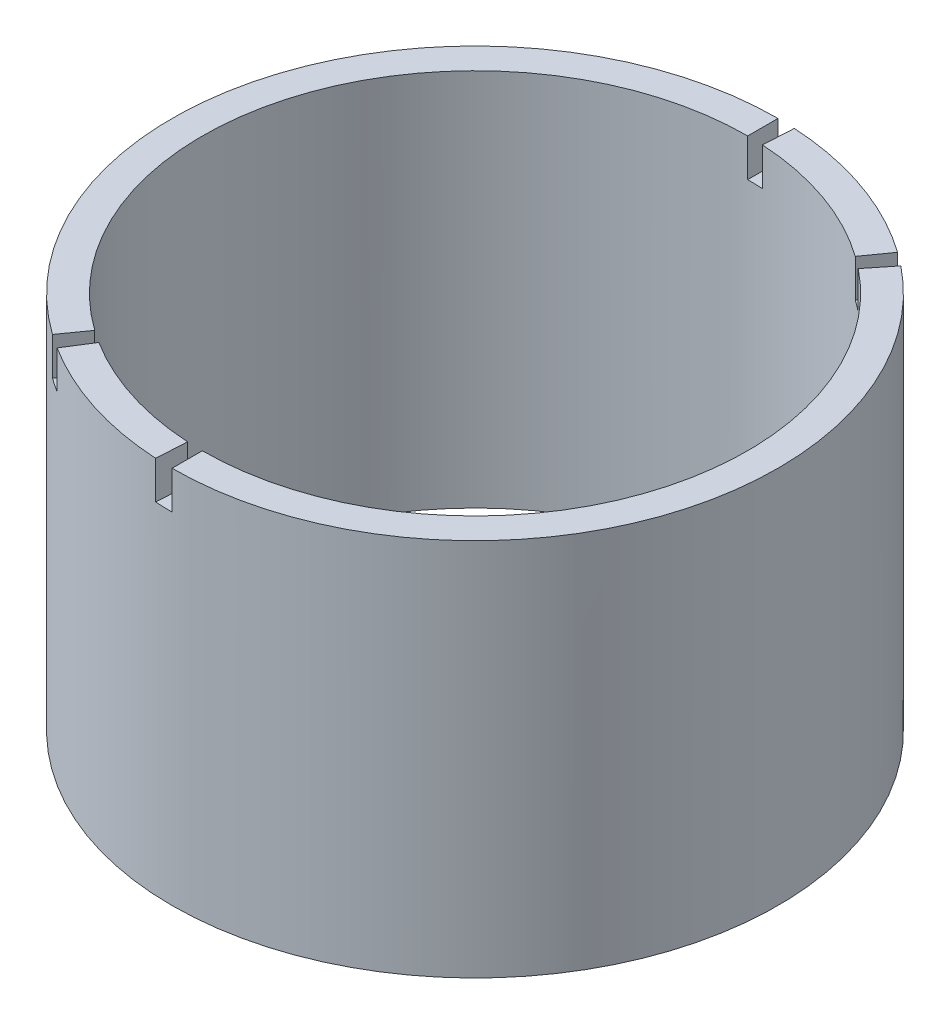
ISO-10303-21;
HEADER;
FILE_DESCRIPTION(('STEP AP214'),'2;1');
FILE_NAME('part.step','',(''),(''),'','','');
FILE_SCHEMA(('AUTOMOTIVE_DESIGN { 1 0 10303 214 1 1 1 1 }'));
ENDSEC;
DATA;
#1=APPLICATION_CONTEXT('core data for automotive mechanical design processes');
#2=APPLICATION_PROTOCOL_DEFINITION('international standard','automotive_design',2000,#1);
#3=PRODUCT_CONTEXT('',#1,'mechanical');
#4=PRODUCT('Part','Part','',(#3));
#5=PRODUCT_RELATED_PRODUCT_CATEGORY('part','',(#4));
#6=PRODUCT_DEFINITION_FORMATION('','',#4);
#7=PRODUCT_DEFINITION_CONTEXT('part definition',#1,'design');
#8=PRODUCT_DEFINITION('design','',#6,#7);
#9=PRODUCT_DEFINITION_SHAPE('','',#8);
#10=(LENGTH_UNIT() NAMED_UNIT(*) SI_UNIT(.MILLI.,.METRE.));
#11=(NAMED_UNIT(*) PLANE_ANGLE_UNIT() SI_UNIT($,.RADIAN.));
#12=(NAMED_UNIT(*) SI_UNIT($,.STERADIAN.) SOLID_ANGLE_UNIT());
#13=UNCERTAINTY_MEASURE_WITH_UNIT(LENGTH_MEASURE(1.E-05),#10,'distance_accuracy_value','');
#14=(GEOMETRIC_REPRESENTATION_CONTEXT(3) GLOBAL_UNCERTAINTY_ASSIGNED_CONTEXT((#13)) GLOBAL_UNIT_ASSIGNED_CONTEXT((#10,
#11,#12)) REPRESENTATION_CONTEXT('',''));
#15=CARTESIAN_POINT('',(0.,0.,0.));
#16=DIRECTION('',(0.,0.,1.));
#17=DIRECTION('',(1.,0.,0.));
#18=AXIS2_PLACEMENT_3D('',#15,#16,#17);
#19=CARTESIAN_POINT('',(0.,50.,0.));
#20=DIRECTION('',(0.,1.,0.));
#21=DIRECTION('',(0.,0.,1.));
#22=AXIS2_PLACEMENT_3D('',#19,#20,#21);
#23=PLANE('',#22);
#24=DIRECTION('',(-0.579849798546337,0.,0.814723395469758));
#25=VECTOR('',#24,1.);
#26=CARTESIAN_POINT('',(-23.1939919418535,50.,32.5889358187903));
#27=LINE('',#26,#25);
#28=CARTESIAN_POINT('',(-20.8745927476682,50.,29.3300422369113));
#29=VERTEX_POINT('',#28);
#30=CARTESIAN_POINT('',(-23.1939919418535,50.,32.5889358187903));
#31=VERTEX_POINT('',#30);
#32=EDGE_CURVE('E161',#29,#31,#27,.T.);
#33=ORIENTED_EDGE('',*,*,#32,.F.);
#34=CARTESIAN_POINT('',(0.,50.,0.));
#35=DIRECTION('',(0.,1.,0.));
#36=DIRECTION('',(0.,0.,1.));
#37=AXIS2_PLACEMENT_3D('',#34,#35,#36);
#38=CIRCLE('',#37,36.);
#39=CARTESIAN_POINT('',(0.,50.,-36.));
#40=VERTEX_POINT('',#39);
#41=EDGE_CURVE('E247',#40,#29,#38,.T.);
#42=ORIENTED_EDGE('',*,*,#41,.F.);
#43=DIRECTION('',(0.,0.,1.));
#44=VECTOR('',#43,1.);
#45=CARTESIAN_POINT('',(0.,50.,-40.));
#46=LINE('',#45,#44);
#47=CARTESIAN_POINT('',(0.,50.,-40.));
#48=VERTEX_POINT('',#47);
#49=EDGE_CURVE('E213',#48,#40,#46,.T.);
#50=ORIENTED_EDGE('',*,*,#49,.F.);
#51=CARTESIAN_POINT('',(0.,50.,0.));
#52=DIRECTION('',(0.,1.,0.));
#53=DIRECTION('',(0.,0.,1.));
#54=AXIS2_PLACEMENT_3D('',#51,#52,#53);
#55=CIRCLE('',#54,40.);
#56=EDGE_CURVE('E11',#48,#31,#55,.T.);
#57=ORIENTED_EDGE('',*,*,#56,.T.);
#58=EDGE_LOOP('',(#33,#42,#50,#57));
#59=FACE_BOUND('',#58,.T.);
#60=ADVANCED_FACE('F31',(#59),#23,.T.);
#61=DIRECTION('',(0.624199913750063,0.,-0.781264659174095));
#62=VECTOR('',#61,1.);
#63=CARTESIAN_POINT('',(24.9679965500025,50.,-31.2505863669638));
#64=LINE('',#63,#62);
#65=CARTESIAN_POINT('',(22.4711968950023,50.,-28.1255277302674));
#66=VERTEX_POINT('',#65);
#67=CARTESIAN_POINT('',(24.9679965500025,50.,-31.2505863669638));
#68=VERTEX_POINT('',#67);
#69=EDGE_CURVE('E174',#66,#68,#64,.T.);
#70=ORIENTED_EDGE('',*,*,#69,.F.);
#71=CARTESIAN_POINT('',(0.,50.,36.));
#72=VERTEX_POINT('',#71);
#73=EDGE_CURVE('E251',#72,#66,#38,.T.);
#74=ORIENTED_EDGE('',*,*,#73,.F.);
#75=DIRECTION('',(0.,0.,-1.));
#76=VECTOR('',#75,1.);
#77=CARTESIAN_POINT('',(0.,50.,40.));
#78=LINE('',#77,#76);
#79=CARTESIAN_POINT('',(0.,50.,40.));
#80=VERTEX_POINT('',#79);
#81=EDGE_CURVE('E189',#80,#72,#78,.T.);
#82=ORIENTED_EDGE('',*,*,#81,.F.);
#83=EDGE_CURVE('E41',#80,#68,#55,.T.);
#84=ORIENTED_EDGE('',*,*,#83,.T.);
#85=EDGE_LOOP('',(#70,#74,#82,#84));
#86=FACE_BOUND('',#85,.T.);
#87=ADVANCED_FACE('F291',(#86),#23,.T.);
#88=DIRECTION('',(0.533710023470557,0.,-0.845667553384341));
#89=VECTOR('',#88,1.);
#90=CARTESIAN_POINT('',(-21.3484009388223,50.,33.8267021353737));
#91=LINE('',#90,#89);
#92=CARTESIAN_POINT('',(-21.3484009388223,50.,33.8267021353737));
#93=VERTEX_POINT('',#92);
#94=CARTESIAN_POINT('',(-19.21356084494,50.,30.4440319218363));
#95=VERTEX_POINT('',#94);
#96=EDGE_CURVE('E272',#93,#95,#91,.T.);
#97=ORIENTED_EDGE('',*,*,#96,.F.);
#98=CARTESIAN_POINT('',(-2.22222222222222,50.,39.9382239013587));
#99=VERTEX_POINT('',#98);
#100=EDGE_CURVE('E40',#93,#99,#55,.T.);
#101=ORIENTED_EDGE('',*,*,#100,.T.);
#102=DIRECTION('',(-0.0555555555555553,0.,0.998455597533968));
#103=VECTOR('',#102,1.);
#104=CARTESIAN_POINT('',(-2.22222222222222,50.,39.9382239013587));
#105=LINE('',#104,#103);
#106=CARTESIAN_POINT('',(-2.,50.,35.9444015112229));
#107=VERTEX_POINT('',#106);
#108=EDGE_CURVE('E200',#107,#99,#105,.T.);
#109=ORIENTED_EDGE('',*,*,#108,.F.);
#110=EDGE_CURVE('E250',#95,#107,#38,.T.);
#111=ORIENTED_EDGE('',*,*,#110,.F.);
#112=EDGE_LOOP('',(#97,#101,#109,#111));
#113=FACE_BOUND('',#112,.T.);
#114=ADVANCED_FACE('F271',(#113),#23,.T.);
#115=DIRECTION('',(-0.579849798546339,0.,0.814723395469757));
#116=VECTOR('',#115,1.);
#117=CARTESIAN_POINT('',(23.1939919418535,50.,-32.5889358187903));
#118=LINE('',#117,#116);
#119=CARTESIAN_POINT('',(23.1939919418535,50.,-32.5889358187903));
#120=VERTEX_POINT('',#119);
#121=CARTESIAN_POINT('',(20.8745927476682,50.,-29.3300422369113));
#122=VERTEX_POINT('',#121);
#123=EDGE_CURVE('E182',#120,#122,#118,.T.);
#124=ORIENTED_EDGE('',*,*,#123,.F.);
#125=CARTESIAN_POINT('',(2.22222222222221,50.,-39.9382239013587));
#126=VERTEX_POINT('',#125);
#127=EDGE_CURVE('E273',#120,#126,#55,.T.);
#128=ORIENTED_EDGE('',*,*,#127,.T.);
#129=DIRECTION('',(0.0555555555555553,0.,-0.998455597533968));
#130=VECTOR('',#129,1.);
#131=CARTESIAN_POINT('',(2.22222222222221,50.,-39.9382239013587));
#132=LINE('',#131,#130);
#133=CARTESIAN_POINT('',(1.99999999999999,50.,-35.9444015112229));
#134=VERTEX_POINT('',#133);
#135=EDGE_CURVE('E225',#134,#126,#132,.T.);
#136=ORIENTED_EDGE('',*,*,#135,.F.);
#137=EDGE_CURVE('E253',#122,#134,#38,.T.);
#138=ORIENTED_EDGE('',*,*,#137,.F.);
#139=EDGE_LOOP('',(#124,#128,#136,#138));
#140=FACE_BOUND('',#139,.T.);
#141=ADVANCED_FACE('F284',(#140),#23,.T.);
#142=CARTESIAN_POINT('',(0.,0.,0.));
#143=DIRECTION('',(0.,1.,0.));
#144=DIRECTION('',(0.,0.,1.));
#145=AXIS2_PLACEMENT_3D('',#142,#143,#144);
#146=PLANE('',#145);
#147=CARTESIAN_POINT('',(0.,0.,0.));
#148=DIRECTION('',(0.,1.,0.));
#149=DIRECTION('',(0.,0.,1.));
#150=AXIS2_PLACEMENT_3D('',#147,#148,#149);
#151=CIRCLE('',#150,40.);
#152=CARTESIAN_POINT('',(0.,0.,40.));
#153=VERTEX_POINT('',#152);
#154=EDGE_CURVE('E35',#153,#153,#151,.T.);
#155=ORIENTED_EDGE('',*,*,#154,.F.);
#156=EDGE_LOOP('',(#155));
#157=FACE_BOUND('',#156,.T.);
#158=CARTESIAN_POINT('',(0.,0.,0.));
#159=DIRECTION('',(0.,1.,0.));
#160=DIRECTION('',(0.,0.,1.));
#161=AXIS2_PLACEMENT_3D('',#158,#159,#160);
#162=CIRCLE('',#161,36.);
#163=CARTESIAN_POINT('',(0.,0.,36.));
#164=VERTEX_POINT('',#163);
#165=EDGE_CURVE('E239',#164,#164,#162,.T.);
#166=ORIENTED_EDGE('',*,*,#165,.T.);
#167=EDGE_LOOP('',(#166));
#168=FACE_BOUND('',#167,.T.);
#169=ADVANCED_FACE('F282',(#157,#168),#146,.F.);
#170=CARTESIAN_POINT('',(0.,50.,0.));
#171=DIRECTION('',(0.,-1.,0.));
#172=DIRECTION('',(0.,0.,-1.));
#173=AXIS2_PLACEMENT_3D('',#170,#171,#172);
#174=CYLINDRICAL_SURFACE('',#173,40.);
#175=CARTESIAN_POINT('',(0.,45.,0.));
#176=DIRECTION('',(0.,1.,0.));
#177=DIRECTION('',(0.,0.,-1.));
#178=AXIS2_PLACEMENT_3D('',#175,#176,#177);
#179=CIRCLE('',#178,40.);
#180=CARTESIAN_POINT('',(-23.1939919418535,45.,32.5889358187903));
#181=VERTEX_POINT('',#180);
#182=CARTESIAN_POINT('',(-21.3484009388223,45.,33.8267021353737));
#183=VERTEX_POINT('',#182);
#184=EDGE_CURVE('E152',#181,#183,#179,.T.);
#185=ORIENTED_EDGE('',*,*,#184,.F.);
#186=DIRECTION('',(0.,1.,0.));
#187=VECTOR('',#186,1.);
#188=CARTESIAN_POINT('',(-23.1939919418535,45.,32.5889358187903));
#189=LINE('',#188,#187);
#190=EDGE_CURVE('E184',#181,#31,#189,.T.);
#191=ORIENTED_EDGE('',*,*,#190,.T.);
#192=ORIENTED_EDGE('',*,*,#56,.F.);
#193=DIRECTION('',(0.,1.,0.));
#194=VECTOR('',#193,1.);
#195=CARTESIAN_POINT('',(0.,45.,-40.));
#196=LINE('',#195,#194);
#197=CARTESIAN_POINT('',(0.,45.,-40.));
#198=VERTEX_POINT('',#197);
#199=EDGE_CURVE('E232',#198,#48,#196,.T.);
#200=ORIENTED_EDGE('',*,*,#199,.F.);
#201=CARTESIAN_POINT('',(0.,45.,0.));
#202=DIRECTION('',(0.,1.,0.));
#203=DIRECTION('',(0.,0.,-1.));
#204=AXIS2_PLACEMENT_3D('',#201,#202,#203);
#205=CIRCLE('',#204,40.);
#206=CARTESIAN_POINT('',(2.22222222222221,45.,-39.9382239013587));
#207=VERTEX_POINT('',#206);
#208=EDGE_CURVE('E221',#207,#198,#205,.T.);
#209=ORIENTED_EDGE('',*,*,#208,.F.);
#210=DIRECTION('',(0.,1.,0.));
#211=VECTOR('',#210,1.);
#212=CARTESIAN_POINT('',(2.22222222222221,45.,-39.9382239013587));
#213=LINE('',#212,#211);
#214=EDGE_CURVE('E236',#207,#126,#213,.T.);
#215=ORIENTED_EDGE('',*,*,#214,.T.);
#216=ORIENTED_EDGE('',*,*,#127,.F.);
#217=DIRECTION('',(0.,1.,0.));
#218=VECTOR('',#217,1.);
#219=CARTESIAN_POINT('',(23.1939919418535,45.,-32.5889358187903));
#220=LINE('',#219,#218);
#221=CARTESIAN_POINT('',(23.1939919418535,45.,-32.5889358187903));
#222=VERTEX_POINT('',#221);
#223=EDGE_CURVE('E181',#222,#120,#220,.T.);
#224=ORIENTED_EDGE('',*,*,#223,.F.);
#225=CARTESIAN_POINT('',(0.,45.,0.));
#226=DIRECTION('',(0.,1.,0.));
#227=DIRECTION('',(0.,0.,-1.));
#228=AXIS2_PLACEMENT_3D('',#225,#226,#227);
#229=CIRCLE('',#228,40.);
#230=CARTESIAN_POINT('',(24.9679965500025,45.,-31.2505863669638));
#231=VERTEX_POINT('',#230);
#232=EDGE_CURVE('E172',#231,#222,#229,.T.);
#233=ORIENTED_EDGE('',*,*,#232,.F.);
#234=DIRECTION('',(0.,1.,0.));
#235=VECTOR('',#234,1.);
#236=CARTESIAN_POINT('',(24.9679965500025,45.,-31.2505863669638));
#237=LINE('',#236,#235);
#238=EDGE_CURVE('E186',#231,#68,#237,.T.);
#239=ORIENTED_EDGE('',*,*,#238,.T.);
#240=ORIENTED_EDGE('',*,*,#83,.F.);
#241=DIRECTION('',(0.,1.,0.));
#242=VECTOR('',#241,1.);
#243=CARTESIAN_POINT('',(0.,45.,40.));
#244=LINE('',#243,#242);
#245=CARTESIAN_POINT('',(0.,45.,40.));
#246=VERTEX_POINT('',#245);
#247=EDGE_CURVE('E207',#246,#80,#244,.T.);
#248=ORIENTED_EDGE('',*,*,#247,.F.);
#249=CARTESIAN_POINT('',(0.,45.,0.));
#250=DIRECTION('',(0.,1.,0.));
#251=DIRECTION('',(0.,0.,1.));
#252=AXIS2_PLACEMENT_3D('',#249,#250,#251);
#253=CIRCLE('',#252,40.);
#254=CARTESIAN_POINT('',(-2.22222222222222,45.,39.9382239013587));
#255=VERTEX_POINT('',#254);
#256=EDGE_CURVE('E196',#255,#246,#253,.T.);
#257=ORIENTED_EDGE('',*,*,#256,.F.);
#258=DIRECTION('',(0.,1.,0.));
#259=VECTOR('',#258,1.);
#260=CARTESIAN_POINT('',(-2.22222222222222,45.,39.9382239013587));
#261=LINE('',#260,#259);
#262=EDGE_CURVE('E211',#255,#99,#261,.T.);
#263=ORIENTED_EDGE('',*,*,#262,.T.);
#264=ORIENTED_EDGE('',*,*,#100,.F.);
#265=DIRECTION('',(0.,1.,0.));
#266=VECTOR('',#265,1.);
#267=CARTESIAN_POINT('',(-21.3484009388223,45.,33.8267021353737));
#268=LINE('',#267,#266);
#269=EDGE_CURVE('E146',#183,#93,#268,.T.);
#270=ORIENTED_EDGE('',*,*,#269,.F.);
#271=EDGE_LOOP('',(#185,#191,#192,#200,#209,#215,#216,#224,#233,#239,#240,#248,#257,#263,#264,#270));
#272=FACE_BOUND('',#271,.T.);
#273=ORIENTED_EDGE('',*,*,#154,.T.);
#274=EDGE_LOOP('',(#273));
#275=FACE_BOUND('',#274,.T.);
#276=ADVANCED_FACE('F33',(#272,#275),#174,.T.);
#277=CARTESIAN_POINT('',(0.,50.,0.));
#278=DIRECTION('',(0.,-1.,0.));
#279=DIRECTION('',(0.,0.,-1.));
#280=AXIS2_PLACEMENT_3D('',#277,#278,#279);
#281=CYLINDRICAL_SURFACE('',#280,36.);
#282=DIRECTION('',(0.,1.,0.));
#283=VECTOR('',#282,1.);
#284=CARTESIAN_POINT('',(-20.8745927476682,45.,29.3300422369113));
#285=LINE('',#284,#283);
#286=CARTESIAN_POINT('',(-20.8745927476682,45.,29.3300422369113));
#287=VERTEX_POINT('',#286);
#288=EDGE_CURVE('E167',#287,#29,#285,.T.);
#289=ORIENTED_EDGE('',*,*,#288,.F.);
#290=CARTESIAN_POINT('',(0.,45.,0.));
#291=DIRECTION('',(0.,-1.,0.));
#292=DIRECTION('',(0.,0.,-1.));
#293=AXIS2_PLACEMENT_3D('',#290,#291,#292);
#294=CIRCLE('',#293,36.);
#295=CARTESIAN_POINT('',(-19.21356084494,45.,30.4440319218363));
#296=VERTEX_POINT('',#295);
#297=EDGE_CURVE('E151',#296,#287,#294,.T.);
#298=ORIENTED_EDGE('',*,*,#297,.F.);
#299=DIRECTION('',(0.,1.,0.));
#300=VECTOR('',#299,1.);
#301=CARTESIAN_POINT('',(-19.21356084494,45.,30.4440319218363));
#302=LINE('',#301,#300);
#303=EDGE_CURVE('E149',#296,#95,#302,.T.);
#304=ORIENTED_EDGE('',*,*,#303,.T.);
#305=ORIENTED_EDGE('',*,*,#110,.T.);
#306=DIRECTION('',(0.,1.,0.));
#307=VECTOR('',#306,1.);
#308=CARTESIAN_POINT('',(-2.,45.,35.9444015112229));
#309=LINE('',#308,#307);
#310=CARTESIAN_POINT('',(-2.,45.,35.9444015112229));
#311=VERTEX_POINT('',#310);
#312=EDGE_CURVE('E214',#311,#107,#309,.T.);
#313=ORIENTED_EDGE('',*,*,#312,.F.);
#314=CARTESIAN_POINT('',(0.,45.,0.));
#315=DIRECTION('',(0.,-1.,0.));
#316=DIRECTION('',(0.,0.,1.));
#317=AXIS2_PLACEMENT_3D('',#314,#315,#316);
#318=CIRCLE('',#317,36.);
#319=CARTESIAN_POINT('',(0.,45.,36.));
#320=VERTEX_POINT('',#319);
#321=EDGE_CURVE('E202',#320,#311,#318,.T.);
#322=ORIENTED_EDGE('',*,*,#321,.F.);
#323=DIRECTION('',(0.,1.,0.));
#324=VECTOR('',#323,1.);
#325=CARTESIAN_POINT('',(0.,45.,36.));
#326=LINE('',#325,#324);
#327=EDGE_CURVE('E217',#320,#72,#326,.T.);
#328=ORIENTED_EDGE('',*,*,#327,.T.);
#329=ORIENTED_EDGE('',*,*,#73,.T.);
#330=DIRECTION('',(0.,1.,0.));
#331=VECTOR('',#330,1.);
#332=CARTESIAN_POINT('',(22.4711968950023,45.,-28.1255277302674));
#333=LINE('',#332,#331);
#334=CARTESIAN_POINT('',(22.4711968950023,45.,-28.1255277302674));
#335=VERTEX_POINT('',#334);
#336=EDGE_CURVE('E190',#335,#66,#333,.T.);
#337=ORIENTED_EDGE('',*,*,#336,.F.);
#338=CARTESIAN_POINT('',(0.,45.,0.));
#339=DIRECTION('',(0.,-1.,0.));
#340=DIRECTION('',(0.,0.,-1.));
#341=AXIS2_PLACEMENT_3D('',#338,#339,#340);
#342=CIRCLE('',#341,36.);
#343=CARTESIAN_POINT('',(20.8745927476682,45.,-29.3300422369113));
#344=VERTEX_POINT('',#343);
#345=EDGE_CURVE('E176',#344,#335,#342,.T.);
#346=ORIENTED_EDGE('',*,*,#345,.F.);
#347=DIRECTION('',(0.,1.,0.));
#348=VECTOR('',#347,1.);
#349=CARTESIAN_POINT('',(20.8745927476682,45.,-29.3300422369113));
#350=LINE('',#349,#348);
#351=EDGE_CURVE('E192',#344,#122,#350,.T.);
#352=ORIENTED_EDGE('',*,*,#351,.T.);
#353=ORIENTED_EDGE('',*,*,#137,.T.);
#354=DIRECTION('',(0.,1.,0.));
#355=VECTOR('',#354,1.);
#356=CARTESIAN_POINT('',(1.99999999999999,45.,-35.9444015112229));
#357=LINE('',#356,#355);
#358=CARTESIAN_POINT('',(1.99999999999999,45.,-35.9444015112229));
#359=VERTEX_POINT('',#358);
#360=EDGE_CURVE('E240',#359,#134,#357,.T.);
#361=ORIENTED_EDGE('',*,*,#360,.F.);
#362=CARTESIAN_POINT('',(0.,45.,0.));
#363=DIRECTION('',(0.,-1.,0.));
#364=DIRECTION('',(0.,0.,-1.));
#365=AXIS2_PLACEMENT_3D('',#362,#363,#364);
#366=CIRCLE('',#365,36.);
#367=CARTESIAN_POINT('',(0.,45.,-36.));
#368=VERTEX_POINT('',#367);
#369=EDGE_CURVE('E227',#368,#359,#366,.T.);
#370=ORIENTED_EDGE('',*,*,#369,.F.);
#371=DIRECTION('',(0.,1.,0.));
#372=VECTOR('',#371,1.);
#373=CARTESIAN_POINT('',(0.,45.,-36.));
#374=LINE('',#373,#372);
#375=EDGE_CURVE('E243',#368,#40,#374,.T.);
#376=ORIENTED_EDGE('',*,*,#375,.T.);
#377=ORIENTED_EDGE('',*,*,#41,.T.);
#378=EDGE_LOOP('',(#289,#298,#304,#305,#313,#322,#328,#329,#337,#346,#352,#353,#361,#370,#376,#377));
#379=FACE_BOUND('',#378,.T.);
#380=ORIENTED_EDGE('',*,*,#165,.F.);
#381=EDGE_LOOP('',(#380));
#382=FACE_BOUND('',#381,.T.);
#383=ADVANCED_FACE('F263',(#379,#382),#281,.F.);
#384=CARTESIAN_POINT('',(2.22222222222221,45.,-39.9382239013587));
#385=DIRECTION('',(0.998455597533968,0.,0.0555555555555553));
#386=DIRECTION('',(0.0555555555555553,0.,-0.998455597533968));
#387=AXIS2_PLACEMENT_3D('',#384,#385,#386);
#388=PLANE('',#387);
#389=ORIENTED_EDGE('',*,*,#135,.T.);
#390=ORIENTED_EDGE('',*,*,#214,.F.);
#391=DIRECTION('',(0.0555555555555553,0.,-0.998455597533968));
#392=VECTOR('',#391,1.);
#393=CARTESIAN_POINT('',(2.22222222222221,45.,-39.9382239013587));
#394=LINE('',#393,#392);
#395=EDGE_CURVE('E229',#359,#207,#394,.T.);
#396=ORIENTED_EDGE('',*,*,#395,.F.);
#397=ORIENTED_EDGE('',*,*,#360,.T.);
#398=EDGE_LOOP('',(#389,#390,#396,#397));
#399=FACE_BOUND('',#398,.T.);
#400=ADVANCED_FACE('F301',(#399),#388,.F.);
#401=CARTESIAN_POINT('',(0.,45.,-40.));
#402=DIRECTION('',(-1.,0.,0.));
#403=DIRECTION('',(0.,0.,1.));
#404=AXIS2_PLACEMENT_3D('',#401,#402,#403);
#405=PLANE('',#404);
#406=ORIENTED_EDGE('',*,*,#49,.T.);
#407=ORIENTED_EDGE('',*,*,#375,.F.);
#408=DIRECTION('',(0.,0.,1.));
#409=VECTOR('',#408,1.);
#410=CARTESIAN_POINT('',(0.,45.,-40.));
#411=LINE('',#410,#409);
#412=EDGE_CURVE('E224',#198,#368,#411,.T.);
#413=ORIENTED_EDGE('',*,*,#412,.F.);
#414=ORIENTED_EDGE('',*,*,#199,.T.);
#415=EDGE_LOOP('',(#406,#407,#413,#414));
#416=FACE_BOUND('',#415,.T.);
#417=ADVANCED_FACE('F302',(#416),#405,.F.);
#418=CARTESIAN_POINT('',(0.,45.,0.));
#419=DIRECTION('',(0.,-1.,0.));
#420=DIRECTION('',(0.,0.,-1.));
#421=AXIS2_PLACEMENT_3D('',#418,#419,#420);
#422=PLANE('',#421);
#423=ORIENTED_EDGE('',*,*,#208,.T.);
#424=ORIENTED_EDGE('',*,*,#412,.T.);
#425=ORIENTED_EDGE('',*,*,#369,.T.);
#426=ORIENTED_EDGE('',*,*,#395,.T.);
#427=EDGE_LOOP('',(#423,#424,#425,#426));
#428=FACE_BOUND('',#427,.T.);
#429=ADVANCED_FACE('F305',(#428),#422,.F.);
#430=CARTESIAN_POINT('',(-2.22222222222222,45.,39.9382239013587));
#431=DIRECTION('',(-0.998455597533968,0.,-0.0555555555555553));
#432=DIRECTION('',(-0.0555555555555553,0.,0.998455597533968));
#433=AXIS2_PLACEMENT_3D('',#430,#431,#432);
#434=PLANE('',#433);
#435=ORIENTED_EDGE('',*,*,#108,.T.);
#436=ORIENTED_EDGE('',*,*,#262,.F.);
#437=DIRECTION('',(-0.0555555555555553,0.,0.998455597533968));
#438=VECTOR('',#437,1.);
#439=CARTESIAN_POINT('',(-2.22222222222222,45.,39.9382239013587));
#440=LINE('',#439,#438);
#441=EDGE_CURVE('E204',#311,#255,#440,.T.);
#442=ORIENTED_EDGE('',*,*,#441,.F.);
#443=ORIENTED_EDGE('',*,*,#312,.T.);
#444=EDGE_LOOP('',(#435,#436,#442,#443));
#445=FACE_BOUND('',#444,.T.);
#446=ADVANCED_FACE('F270',(#445),#434,.F.);
#447=CARTESIAN_POINT('',(0.,45.,40.));
#448=DIRECTION('',(1.,0.,0.));
#449=DIRECTION('',(0.,0.,-1.));
#450=AXIS2_PLACEMENT_3D('',#447,#448,#449);
#451=PLANE('',#450);
#452=ORIENTED_EDGE('',*,*,#81,.T.);
#453=ORIENTED_EDGE('',*,*,#327,.F.);
#454=DIRECTION('',(0.,0.,-1.));
#455=VECTOR('',#454,1.);
#456=CARTESIAN_POINT('',(0.,45.,40.));
#457=LINE('',#456,#455);
#458=EDGE_CURVE('E199',#246,#320,#457,.T.);
#459=ORIENTED_EDGE('',*,*,#458,.F.);
#460=ORIENTED_EDGE('',*,*,#247,.T.);
#461=EDGE_LOOP('',(#452,#453,#459,#460));
#462=FACE_BOUND('',#461,.T.);
#463=ADVANCED_FACE('F313',(#462),#451,.F.);
#464=CARTESIAN_POINT('',(0.,45.,0.));
#465=DIRECTION('',(0.,1.,0.));
#466=DIRECTION('',(0.,0.,1.));
#467=AXIS2_PLACEMENT_3D('',#464,#465,#466);
#468=PLANE('',#467);
#469=ORIENTED_EDGE('',*,*,#256,.T.);
#470=ORIENTED_EDGE('',*,*,#458,.T.);
#471=ORIENTED_EDGE('',*,*,#321,.T.);
#472=ORIENTED_EDGE('',*,*,#441,.T.);
#473=EDGE_LOOP('',(#469,#470,#471,#472));
#474=FACE_BOUND('',#473,.T.);
#475=ADVANCED_FACE('F316',(#474),#468,.T.);
#476=CARTESIAN_POINT('',(24.9679965500025,45.,-31.2505863669638));
#477=DIRECTION('',(0.781264659174095,0.,0.624199913750063));
#478=DIRECTION('',(0.624199913750063,0.,-0.781264659174095));
#479=AXIS2_PLACEMENT_3D('',#476,#477,#478);
#480=PLANE('',#479);
#481=ORIENTED_EDGE('',*,*,#69,.T.);
#482=ORIENTED_EDGE('',*,*,#238,.F.);
#483=DIRECTION('',(0.624199913750063,0.,-0.781264659174095));
#484=VECTOR('',#483,1.);
#485=CARTESIAN_POINT('',(24.9679965500025,45.,-31.2505863669638));
#486=LINE('',#485,#484);
#487=EDGE_CURVE('E178',#335,#231,#486,.T.);
#488=ORIENTED_EDGE('',*,*,#487,.F.);
#489=ORIENTED_EDGE('',*,*,#336,.T.);
#490=EDGE_LOOP('',(#481,#482,#488,#489));
#491=FACE_BOUND('',#490,.T.);
#492=ADVANCED_FACE('F322',(#491),#480,.F.);
#493=CARTESIAN_POINT('',(23.1939919418535,45.,-32.5889358187903));
#494=DIRECTION('',(-0.814723395469757,0.,-0.579849798546339));
#495=DIRECTION('',(-0.579849798546339,0.,0.814723395469757));
#496=AXIS2_PLACEMENT_3D('',#493,#494,#495);
#497=PLANE('',#496);
#498=ORIENTED_EDGE('',*,*,#123,.T.);
#499=ORIENTED_EDGE('',*,*,#351,.F.);
#500=DIRECTION('',(-0.579849798546339,0.,0.814723395469757));
#501=VECTOR('',#500,1.);
#502=CARTESIAN_POINT('',(23.1939919418535,45.,-32.5889358187903));
#503=LINE('',#502,#501);
#504=EDGE_CURVE('E56',#222,#344,#503,.T.);
#505=ORIENTED_EDGE('',*,*,#504,.F.);
#506=ORIENTED_EDGE('',*,*,#223,.T.);
#507=EDGE_LOOP('',(#498,#499,#505,#506));
#508=FACE_BOUND('',#507,.T.);
#509=ADVANCED_FACE('F324',(#508),#497,.F.);
#510=CARTESIAN_POINT('',(0.,45.,0.));
#511=DIRECTION('',(0.,-1.,0.));
#512=DIRECTION('',(0.,0.,-1.));
#513=AXIS2_PLACEMENT_3D('',#510,#511,#512);
#514=PLANE('',#513);
#515=ORIENTED_EDGE('',*,*,#232,.T.);
#516=ORIENTED_EDGE('',*,*,#504,.T.);
#517=ORIENTED_EDGE('',*,*,#345,.T.);
#518=ORIENTED_EDGE('',*,*,#487,.T.);
#519=EDGE_LOOP('',(#515,#516,#517,#518));
#520=FACE_BOUND('',#519,.T.);
#521=ADVANCED_FACE('F327',(#520),#514,.F.);
#522=CARTESIAN_POINT('',(-23.1939919418535,45.,32.5889358187903));
#523=DIRECTION('',(-0.814723395469758,0.,-0.579849798546337));
#524=DIRECTION('',(-0.579849798546337,0.,0.814723395469758));
#525=AXIS2_PLACEMENT_3D('',#522,#523,#524);
#526=PLANE('',#525);
#527=ORIENTED_EDGE('',*,*,#32,.T.);
#528=ORIENTED_EDGE('',*,*,#190,.F.);
#529=DIRECTION('',(-0.579849798546337,0.,0.814723395469758));
#530=VECTOR('',#529,1.);
#531=CARTESIAN_POINT('',(-23.1939919418535,45.,32.5889358187903));
#532=LINE('',#531,#530);
#533=EDGE_CURVE('E158',#287,#181,#532,.T.);
#534=ORIENTED_EDGE('',*,*,#533,.F.);
#535=ORIENTED_EDGE('',*,*,#288,.T.);
#536=EDGE_LOOP('',(#527,#528,#534,#535));
#537=FACE_BOUND('',#536,.T.);
#538=ADVANCED_FACE('F334',(#537),#526,.F.);
#539=CARTESIAN_POINT('',(-21.3484009388223,45.,33.8267021353737));
#540=DIRECTION('',(0.845667553384341,0.,0.533710023470557));
#541=DIRECTION('',(0.533710023470557,0.,-0.845667553384341));
#542=AXIS2_PLACEMENT_3D('',#539,#540,#541);
#543=PLANE('',#542);
#544=ORIENTED_EDGE('',*,*,#96,.T.);
#545=ORIENTED_EDGE('',*,*,#303,.F.);
#546=DIRECTION('',(0.533710023470557,0.,-0.845667553384341));
#547=VECTOR('',#546,1.);
#548=CARTESIAN_POINT('',(-21.3484009388223,45.,33.8267021353737));
#549=LINE('',#548,#547);
#550=EDGE_CURVE('E48',#183,#296,#549,.T.);
#551=ORIENTED_EDGE('',*,*,#550,.F.);
#552=ORIENTED_EDGE('',*,*,#269,.T.);
#553=EDGE_LOOP('',(#544,#545,#551,#552));
#554=FACE_BOUND('',#553,.T.);
#555=ADVANCED_FACE('F144',(#554),#543,.F.);
#556=CARTESIAN_POINT('',(0.,45.,0.));
#557=DIRECTION('',(0.,-1.,0.));
#558=DIRECTION('',(0.,0.,-1.));
#559=AXIS2_PLACEMENT_3D('',#556,#557,#558);
#560=PLANE('',#559);
#561=ORIENTED_EDGE('',*,*,#184,.T.);
#562=ORIENTED_EDGE('',*,*,#550,.T.);
#563=ORIENTED_EDGE('',*,*,#297,.T.);
#564=ORIENTED_EDGE('',*,*,#533,.T.);
#565=EDGE_LOOP('',(#561,#562,#563,#564));
#566=FACE_BOUND('',#565,.T.);
#567=ADVANCED_FACE('F156',(#566),#560,.F.);
#568=CLOSED_SHELL('',(#60,#87,#114,#141,#169,#276,#383,#400,#417,#429,#446,#463,#475,#492,#509,
#521,#538,#555,#567));
#569=MANIFOLD_SOLID_BREP('B2',#568);
#570=ADVANCED_BREP_SHAPE_REPRESENTATION('',(#18,#569),#14);
#571=SHAPE_DEFINITION_REPRESENTATION(#9,#570);
ENDSEC;
END-ISO-10303-21;
